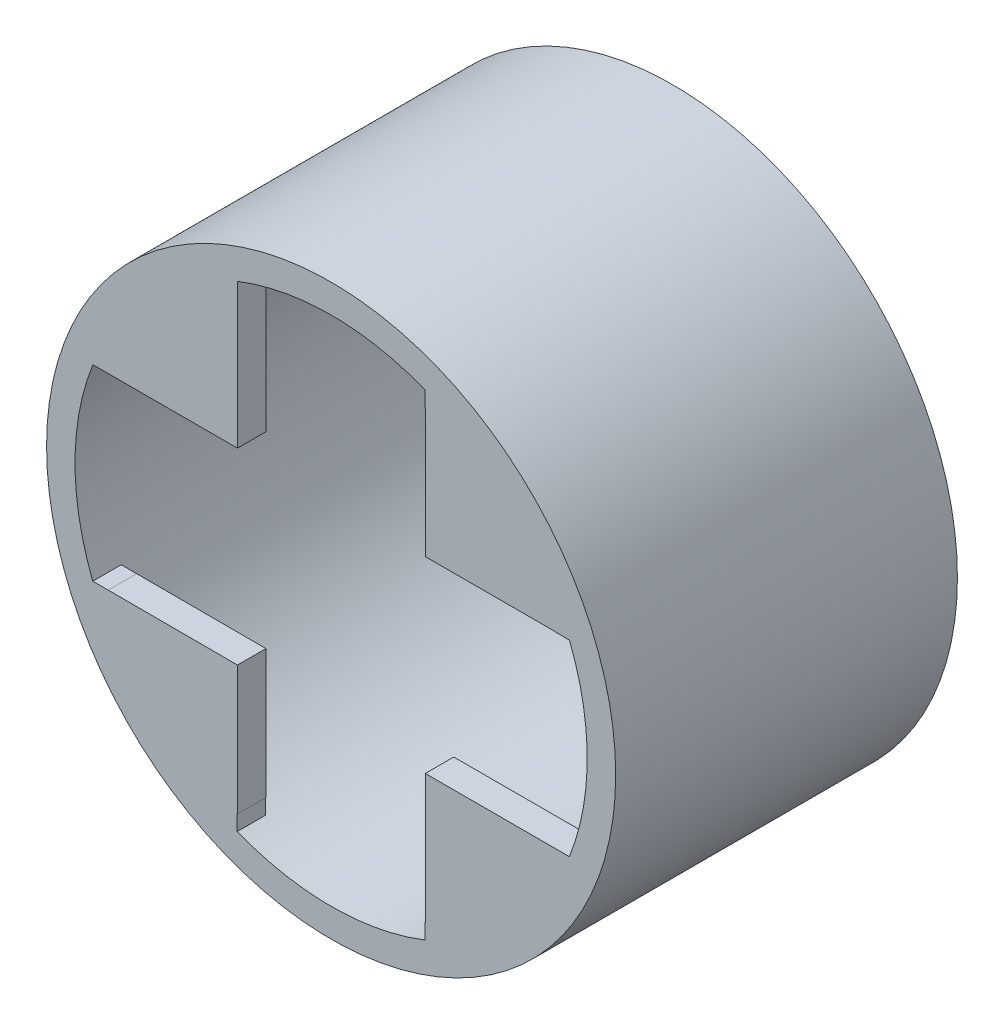
ISO-10303-21;
HEADER;
FILE_DESCRIPTION(('STEP AP214'),'2;1');
FILE_NAME('part.step','',(''),(''),'','','');
FILE_SCHEMA(('AUTOMOTIVE_DESIGN { 1 0 10303 214 1 1 1 1 }'));
ENDSEC;
DATA;
#1=APPLICATION_CONTEXT('core data for automotive mechanical design processes');
#2=APPLICATION_PROTOCOL_DEFINITION('international standard','automotive_design',2000,#1);
#3=PRODUCT_CONTEXT('',#1,'mechanical');
#4=PRODUCT('Part','Part','',(#3));
#5=PRODUCT_RELATED_PRODUCT_CATEGORY('part','',(#4));
#6=PRODUCT_DEFINITION_FORMATION('','',#4);
#7=PRODUCT_DEFINITION_CONTEXT('part definition',#1,'design');
#8=PRODUCT_DEFINITION('design','',#6,#7);
#9=PRODUCT_DEFINITION_SHAPE('','',#8);
#10=(LENGTH_UNIT() NAMED_UNIT(*) SI_UNIT(.MILLI.,.METRE.));
#11=(NAMED_UNIT(*) PLANE_ANGLE_UNIT() SI_UNIT($,.RADIAN.));
#12=(NAMED_UNIT(*) SI_UNIT($,.STERADIAN.) SOLID_ANGLE_UNIT());
#13=UNCERTAINTY_MEASURE_WITH_UNIT(LENGTH_MEASURE(1.E-05),#10,'distance_accuracy_value','');
#14=(GEOMETRIC_REPRESENTATION_CONTEXT(3) GLOBAL_UNCERTAINTY_ASSIGNED_CONTEXT((#13)) GLOBAL_UNIT_ASSIGNED_CONTEXT((#10,
#11,#12)) REPRESENTATION_CONTEXT('',''));
#15=CARTESIAN_POINT('',(0.,0.,0.));
#16=DIRECTION('',(0.,0.,1.));
#17=DIRECTION('',(1.,0.,0.));
#18=AXIS2_PLACEMENT_3D('',#15,#16,#17);
#19=CARTESIAN_POINT('',(-55.,-65.,10.));
#20=DIRECTION('',(0.,0.,1.));
#21=DIRECTION('',(1.,0.,0.));
#22=AXIS2_PLACEMENT_3D('',#19,#20,#21);
#23=PLANE('',#22);
#24=CARTESIAN_POINT('',(0.,0.,10.));
#25=DIRECTION('',(0.,0.,1.));
#26=DIRECTION('',(1.,0.,0.));
#27=AXIS2_PLACEMENT_3D('',#24,#25,#26);
#28=CIRCLE('',#27,45.);
#29=CARTESIAN_POINT('',(45.,0.,10.));
#30=VERTEX_POINT('',#29);
#31=EDGE_CURVE('E41',#30,#30,#28,.T.);
#32=ORIENTED_EDGE('',*,*,#31,.T.);
#33=EDGE_LOOP('',(#32));
#34=FACE_BOUND('',#33,.T.);
#35=CARTESIAN_POINT('',(0.,0.,10.));
#36=DIRECTION('',(0.,0.,1.));
#37=DIRECTION('',(1.,0.,0.));
#38=AXIS2_PLACEMENT_3D('',#35,#36,#37);
#39=CIRCLE('',#38,50.);
#40=CARTESIAN_POINT('',(50.,0.,10.));
#41=VERTEX_POINT('',#40);
#42=EDGE_CURVE('E213',#41,#41,#39,.T.);
#43=ORIENTED_EDGE('',*,*,#42,.F.);
#44=EDGE_LOOP('',(#43));
#45=FACE_BOUND('',#44,.T.);
#46=ADVANCED_FACE('F37',(#34,#45),#23,.F.);
#47=CARTESIAN_POINT('',(-16.4555308979155,-16.5,70.05));
#48=DIRECTION('',(0.,0.,1.));
#49=DIRECTION('',(1.,0.,0.));
#50=AXIS2_PLACEMENT_3D('',#47,#48,#49);
#51=PLANE('',#50);
#52=CARTESIAN_POINT('',(0.,0.,70.05));
#53=DIRECTION('',(0.,0.,1.));
#54=DIRECTION('',(1.,0.,0.));
#55=AXIS2_PLACEMENT_3D('',#52,#53,#54);
#56=CIRCLE('',#55,50.);
#57=CARTESIAN_POINT('',(50.,0.,70.05));
#58=VERTEX_POINT('',#57);
#59=EDGE_CURVE('E407',#58,#58,#56,.T.);
#60=ORIENTED_EDGE('',*,*,#59,.T.);
#61=EDGE_LOOP('',(#60));
#62=FACE_BOUND('',#61,.T.);
#63=CARTESIAN_POINT('',(0.,0.,70.05));
#64=DIRECTION('',(0.,0.,1.));
#65=DIRECTION('',(1.,0.,0.));
#66=AXIS2_PLACEMENT_3D('',#63,#64,#65);
#67=CIRCLE('',#66,45.);
#68=CARTESIAN_POINT('',(-41.8658572108586,16.5,70.05));
#69=VERTEX_POINT('',#68);
#70=CARTESIAN_POINT('',(-41.8833559169712,-16.4555308979174,70.05));
#71=VERTEX_POINT('',#70);
#72=EDGE_CURVE('E208',#69,#71,#67,.T.);
#73=ORIENTED_EDGE('',*,*,#72,.F.);
#74=DIRECTION('',(-1.,0.,0.));
#75=VECTOR('',#74,1.);
#76=CARTESIAN_POINT('',(0.,16.5,70.05));
#77=LINE('',#76,#75);
#78=CARTESIAN_POINT('',(-16.4555308979174,16.5,70.05));
#79=VERTEX_POINT('',#78);
#80=EDGE_CURVE('E261',#79,#69,#77,.T.);
#81=ORIENTED_EDGE('',*,*,#80,.F.);
#82=DIRECTION('',(0.,-1.,0.));
#83=VECTOR('',#82,1.);
#84=CARTESIAN_POINT('',(-16.4555308979174,0.,70.05));
#85=LINE('',#84,#83);
#86=CARTESIAN_POINT('',(-16.4555308979174,41.8833559169712,70.05));
#87=VERTEX_POINT('',#86);
#88=EDGE_CURVE('E246',#87,#79,#85,.T.);
#89=ORIENTED_EDGE('',*,*,#88,.F.);
#90=CARTESIAN_POINT('',(16.5,41.8658572108586,70.05));
#91=VERTEX_POINT('',#90);
#92=EDGE_CURVE('E214',#91,#87,#67,.T.);
#93=ORIENTED_EDGE('',*,*,#92,.F.);
#94=DIRECTION('',(0.,1.,0.));
#95=VECTOR('',#94,1.);
#96=CARTESIAN_POINT('',(16.5,0.,70.05));
#97=LINE('',#96,#95);
#98=CARTESIAN_POINT('',(16.5,39.1850163055687,70.05));
#99=VERTEX_POINT('',#98);
#100=EDGE_CURVE('E224',#99,#91,#97,.T.);
#101=ORIENTED_EDGE('',*,*,#100,.F.);
#102=CARTESIAN_POINT('',(0.0444691020826324,0.,70.05));
#103=DIRECTION('',(0.,0.,1.));
#104=DIRECTION('',(1.,0.,0.));
#105=AXIS2_PLACEMENT_3D('',#102,#103,#104);
#106=CIRCLE('',#105,42.5);
#107=CARTESIAN_POINT('',(16.5444691020823,39.1663120551334,70.05));
#108=VERTEX_POINT('',#107);
#109=EDGE_CURVE('E234',#108,#99,#106,.T.);
#110=ORIENTED_EDGE('',*,*,#109,.F.);
#111=DIRECTION('',(0.,1.,0.));
#112=VECTOR('',#111,1.);
#113=CARTESIAN_POINT('',(16.5444691020827,0.,70.05));
#114=LINE('',#113,#112);
#115=CARTESIAN_POINT('',(16.5444691020826,16.5000000000019,70.05));
#116=VERTEX_POINT('',#115);
#117=EDGE_CURVE('E243',#116,#108,#114,.T.);
#118=ORIENTED_EDGE('',*,*,#117,.F.);
#119=DIRECTION('',(-1.,0.,0.));
#120=VECTOR('',#119,1.);
#121=CARTESIAN_POINT('',(0.,16.5000000000019,70.05));
#122=LINE('',#121,#120);
#123=CARTESIAN_POINT('',(39.2107811572146,16.5000000000017,70.05));
#124=VERTEX_POINT('',#123);
#125=EDGE_CURVE('E232',#124,#116,#122,.T.);
#126=ORIENTED_EDGE('',*,*,#125,.F.);
#127=CARTESIAN_POINT('',(39.2294854076501,16.4555308979205,70.05));
#128=VERTEX_POINT('',#127);
#129=EDGE_CURVE('E223',#128,#124,#106,.T.);
#130=ORIENTED_EDGE('',*,*,#129,.F.);
#131=DIRECTION('',(1.,0.,0.));
#132=VECTOR('',#131,1.);
#133=CARTESIAN_POINT('',(0.,16.4555308979205,70.05));
#134=LINE('',#133,#132);
#135=CARTESIAN_POINT('',(41.88335591697,16.4555308979205,70.05));
#136=VERTEX_POINT('',#135);
#137=EDGE_CURVE('E220',#128,#136,#134,.T.);
#138=ORIENTED_EDGE('',*,*,#137,.T.);
#139=CARTESIAN_POINT('',(41.8658572108593,-16.4999999999981,70.05));
#140=VERTEX_POINT('',#139);
#141=EDGE_CURVE('E207',#140,#136,#67,.T.);
#142=ORIENTED_EDGE('',*,*,#141,.F.);
#143=DIRECTION('',(1.,0.,0.));
#144=VECTOR('',#143,1.);
#145=CARTESIAN_POINT('',(0.,-16.4999999999981,70.05));
#146=LINE('',#145,#144);
#147=CARTESIAN_POINT('',(16.5444691020845,-16.4999999999981,70.05));
#148=VERTEX_POINT('',#147);
#149=EDGE_CURVE('E218',#148,#140,#146,.T.);
#150=ORIENTED_EDGE('',*,*,#149,.F.);
#151=DIRECTION('',(0.,1.,0.));
#152=VECTOR('',#151,1.);
#153=CARTESIAN_POINT('',(16.5444691020845,0.,70.05));
#154=LINE('',#153,#152);
#155=CARTESIAN_POINT('',(16.5444691020847,-39.1663120551309,70.05));
#156=VERTEX_POINT('',#155);
#157=EDGE_CURVE('E415',#156,#148,#154,.T.);
#158=ORIENTED_EDGE('',*,*,#157,.F.);
#159=CARTESIAN_POINT('',(0.0444691020826324,0.,70.05));
#160=DIRECTION('',(0.,0.,1.));
#161=DIRECTION('',(1.,0.,0.));
#162=AXIS2_PLACEMENT_3D('',#159,#160,#161);
#163=CIRCLE('',#162,42.5);
#164=CARTESIAN_POINT('',(16.4555308979205,-39.2036611904193,70.05));
#165=VERTEX_POINT('',#164);
#166=EDGE_CURVE('E273',#165,#156,#163,.T.);
#167=ORIENTED_EDGE('',*,*,#166,.F.);
#168=DIRECTION('',(0.,-1.,0.));
#169=VECTOR('',#168,1.);
#170=CARTESIAN_POINT('',(16.4555308979205,0.,70.05));
#171=LINE('',#170,#169);
#172=CARTESIAN_POINT('',(16.4555308979205,-41.88335591697,70.05));
#173=VERTEX_POINT('',#172);
#174=EDGE_CURVE('E205',#165,#173,#171,.T.);
#175=ORIENTED_EDGE('',*,*,#174,.T.);
#176=CARTESIAN_POINT('',(-16.4999999999969,-41.8658572108598,70.05));
#177=VERTEX_POINT('',#176);
#178=EDGE_CURVE('E193',#177,#173,#67,.T.);
#179=ORIENTED_EDGE('',*,*,#178,.F.);
#180=DIRECTION('',(0.,-1.,0.));
#181=VECTOR('',#180,1.);
#182=CARTESIAN_POINT('',(-16.4999999999969,0.,70.05));
#183=LINE('',#182,#181);
#184=CARTESIAN_POINT('',(-16.4999999999969,-39.14754835402,70.05));
#185=VERTEX_POINT('',#184);
#186=EDGE_CURVE('E183',#185,#177,#183,.T.);
#187=ORIENTED_EDGE('',*,*,#186,.F.);
#188=CARTESIAN_POINT('',(0.0444691020826324,0.,70.05));
#189=DIRECTION('',(0.,0.,1.));
#190=DIRECTION('',(1.,0.,0.));
#191=AXIS2_PLACEMENT_3D('',#188,#189,#190);
#192=CIRCLE('',#191,42.5);
#193=CARTESIAN_POINT('',(-16.4555308979155,-39.1663120551323,70.05));
#194=VERTEX_POINT('',#193);
#195=EDGE_CURVE('E191',#185,#194,#192,.T.);
#196=ORIENTED_EDGE('',*,*,#195,.T.);
#197=DIRECTION('',(0.,-1.,0.));
#198=VECTOR('',#197,1.);
#199=CARTESIAN_POINT('',(-16.4555308979155,0.,70.05));
#200=LINE('',#199,#198);
#201=CARTESIAN_POINT('',(-16.4555308979155,-16.5,70.05));
#202=VERTEX_POINT('',#201);
#203=EDGE_CURVE('E320',#202,#194,#200,.T.);
#204=ORIENTED_EDGE('',*,*,#203,.F.);
#205=DIRECTION('',(0.99999808300345,-0.00195805756427557,0.));
#206=VECTOR('',#205,1.);
#207=CARTESIAN_POINT('',(-0.0323709782077643,-16.532157554156,70.05));
#208=LINE('',#207,#206);
#209=CARTESIAN_POINT('',(-39.1663120551292,-16.4555308979174,70.05));
#210=VERTEX_POINT('',#209);
#211=EDGE_CURVE('E268',#210,#202,#208,.T.);
#212=ORIENTED_EDGE('',*,*,#211,.F.);
#213=DIRECTION('',(-1.,0.,0.));
#214=VECTOR('',#213,1.);
#215=CARTESIAN_POINT('',(0.,-16.4555308979174,70.05));
#216=LINE('',#215,#214);
#217=EDGE_CURVE('E190',#210,#71,#216,.T.);
#218=ORIENTED_EDGE('',*,*,#217,.T.);
#219=EDGE_LOOP('',(#73,#81,#89,#93,#101,#110,#118,#126,#130,#138,#142,#150,#158,#167,#175,#179,
#187,#196,#204,#212,#218));
#220=FACE_BOUND('',#219,.T.);
#221=ADVANCED_FACE('F202',(#62,#220),#51,.T.);
#222=CARTESIAN_POINT('',(-0.0323709782077643,-16.532157554156,70.05));
#223=DIRECTION('',(0.00195805756427557,0.99999808300345,0.));
#224=DIRECTION('',(-0.99999808300345,0.00195805756427557,0.));
#225=AXIS2_PLACEMENT_3D('',#222,#223,#224);
#226=PLANE('',#225);
#227=DIRECTION('',(0.99999808300345,-0.00195805756427557,0.));
#228=VECTOR('',#227,1.);
#229=CARTESIAN_POINT('',(-0.0323709782077643,-16.532157554156,65.05));
#230=LINE('',#229,#228);
#231=CARTESIAN_POINT('',(-39.1663120551292,-16.4555308979174,65.05));
#232=VERTEX_POINT('',#231);
#233=CARTESIAN_POINT('',(-16.4555308979155,-16.5,65.05));
#234=VERTEX_POINT('',#233);
#235=EDGE_CURVE('E327',#232,#234,#230,.T.);
#236=ORIENTED_EDGE('',*,*,#235,.F.);
#237=DIRECTION('',(0.,0.,-1.));
#238=VECTOR('',#237,1.);
#239=CARTESIAN_POINT('',(-39.1663120551292,-16.4555308979174,70.05));
#240=LINE('',#239,#238);
#241=EDGE_CURVE('E307',#210,#232,#240,.T.);
#242=ORIENTED_EDGE('',*,*,#241,.F.);
#243=ORIENTED_EDGE('',*,*,#211,.T.);
#244=DIRECTION('',(0.,0.,-1.));
#245=VECTOR('',#244,1.);
#246=CARTESIAN_POINT('',(-16.4555308979155,-16.5,70.05));
#247=LINE('',#246,#245);
#248=EDGE_CURVE('E304',#202,#234,#247,.T.);
#249=ORIENTED_EDGE('',*,*,#248,.T.);
#250=EDGE_LOOP('',(#236,#242,#243,#249));
#251=FACE_BOUND('',#250,.T.);
#252=ADVANCED_FACE('F515',(#251),#226,.T.);
#253=CARTESIAN_POINT('',(0.,16.5,70.05));
#254=DIRECTION('',(0.,-1.,0.));
#255=DIRECTION('',(1.,0.,0.));
#256=AXIS2_PLACEMENT_3D('',#253,#254,#255);
#257=PLANE('',#256);
#258=ORIENTED_EDGE('',*,*,#80,.T.);
#259=DIRECTION('',(0.,0.,-1.));
#260=VECTOR('',#259,1.);
#261=CARTESIAN_POINT('',(-41.8658572108586,16.5,75.05));
#262=LINE('',#261,#260);
#263=CARTESIAN_POINT('',(-41.8658572108586,16.5,65.05));
#264=VERTEX_POINT('',#263);
#265=EDGE_CURVE('E257',#69,#264,#262,.T.);
#266=ORIENTED_EDGE('',*,*,#265,.T.);
#267=DIRECTION('',(-1.,0.,0.));
#268=VECTOR('',#267,1.);
#269=CARTESIAN_POINT('',(0.,16.5,65.05));
#270=LINE('',#269,#268);
#271=CARTESIAN_POINT('',(-16.4555308979174,16.5,65.05));
#272=VERTEX_POINT('',#271);
#273=EDGE_CURVE('E346',#272,#264,#270,.T.);
#274=ORIENTED_EDGE('',*,*,#273,.F.);
#275=DIRECTION('',(0.,0.,-1.));
#276=VECTOR('',#275,1.);
#277=CARTESIAN_POINT('',(-16.4555308979174,16.5,70.05));
#278=LINE('',#277,#276);
#279=EDGE_CURVE('E265',#79,#272,#278,.T.);
#280=ORIENTED_EDGE('',*,*,#279,.F.);
#281=EDGE_LOOP('',(#258,#266,#274,#280));
#282=FACE_BOUND('',#281,.T.);
#283=ADVANCED_FACE('F504',(#282),#257,.T.);
#284=CARTESIAN_POINT('',(0.0444691020826324,0.,70.05));
#285=DIRECTION('',(0.,0.,-1.));
#286=DIRECTION('',(-1.,0.,0.));
#287=AXIS2_PLACEMENT_3D('',#284,#285,#286);
#288=CYLINDRICAL_SURFACE('',#287,42.5);
#289=CARTESIAN_POINT('',(0.0444691020826324,0.,65.05));
#290=DIRECTION('',(0.,0.,1.));
#291=DIRECTION('',(1.,0.,0.));
#292=AXIS2_PLACEMENT_3D('',#289,#290,#291);
#293=CIRCLE('',#292,42.5);
#294=CARTESIAN_POINT('',(39.2294854076501,16.4555308979205,65.05));
#295=VERTEX_POINT('',#294);
#296=CARTESIAN_POINT('',(39.2107811572146,16.5000000000017,65.05));
#297=VERTEX_POINT('',#296);
#298=EDGE_CURVE('E381',#295,#297,#293,.T.);
#299=ORIENTED_EDGE('',*,*,#298,.F.);
#300=DIRECTION('',(0.,0.,-1.));
#301=VECTOR('',#300,1.);
#302=CARTESIAN_POINT('',(39.2294854076501,16.4555308979205,70.05));
#303=LINE('',#302,#301);
#304=EDGE_CURVE('E356',#128,#295,#303,.T.);
#305=ORIENTED_EDGE('',*,*,#304,.F.);
#306=ORIENTED_EDGE('',*,*,#129,.T.);
#307=DIRECTION('',(0.,0.,-1.));
#308=VECTOR('',#307,1.);
#309=CARTESIAN_POINT('',(39.2107811572146,16.5000000000017,70.05));
#310=LINE('',#309,#308);
#311=EDGE_CURVE('E353',#124,#297,#310,.T.);
#312=ORIENTED_EDGE('',*,*,#311,.T.);
#313=EDGE_LOOP('',(#299,#305,#306,#312));
#314=FACE_BOUND('',#313,.T.);
#315=ADVANCED_FACE('F456',(#314),#288,.F.);
#316=CARTESIAN_POINT('',(0.,-16.4999999999981,70.05));
#317=DIRECTION('',(0.,1.,0.));
#318=DIRECTION('',(-1.,0.,0.));
#319=AXIS2_PLACEMENT_3D('',#316,#317,#318);
#320=PLANE('',#319);
#321=ORIENTED_EDGE('',*,*,#149,.T.);
#322=DIRECTION('',(0.,0.,-1.));
#323=VECTOR('',#322,1.);
#324=CARTESIAN_POINT('',(41.8658572108593,-16.4999999999981,75.05));
#325=LINE('',#324,#323);
#326=CARTESIAN_POINT('',(41.8658572108593,-16.4999999999981,65.05));
#327=VERTEX_POINT('',#326);
#328=EDGE_CURVE('E47',#140,#327,#325,.T.);
#329=ORIENTED_EDGE('',*,*,#328,.T.);
#330=DIRECTION('',(1.,0.,0.));
#331=VECTOR('',#330,1.);
#332=CARTESIAN_POINT('',(0.,-16.4999999999981,65.05));
#333=LINE('',#332,#331);
#334=CARTESIAN_POINT('',(16.5444691020845,-16.4999999999981,65.05));
#335=VERTEX_POINT('',#334);
#336=EDGE_CURVE('E260',#335,#327,#333,.T.);
#337=ORIENTED_EDGE('',*,*,#336,.F.);
#338=DIRECTION('',(0.,0.,-1.));
#339=VECTOR('',#338,1.);
#340=CARTESIAN_POINT('',(16.5444691020845,-16.4999999999981,70.05));
#341=LINE('',#340,#339);
#342=EDGE_CURVE('E389',#148,#335,#341,.T.);
#343=ORIENTED_EDGE('',*,*,#342,.F.);
#344=EDGE_LOOP('',(#321,#329,#337,#343));
#345=FACE_BOUND('',#344,.T.);
#346=ADVANCED_FACE('F281',(#345),#320,.T.);
#347=CARTESIAN_POINT('',(16.5444691020845,0.,70.05));
#348=DIRECTION('',(-1.,0.,0.));
#349=DIRECTION('',(0.,-1.,0.));
#350=AXIS2_PLACEMENT_3D('',#347,#348,#349);
#351=PLANE('',#350);
#352=DIRECTION('',(0.,1.,0.));
#353=VECTOR('',#352,1.);
#354=CARTESIAN_POINT('',(16.5444691020845,0.,65.05));
#355=LINE('',#354,#353);
#356=CARTESIAN_POINT('',(16.5444691020847,-39.1663120551309,65.05));
#357=VERTEX_POINT('',#356);
#358=EDGE_CURVE('E291',#357,#335,#355,.T.);
#359=ORIENTED_EDGE('',*,*,#358,.F.);
#360=DIRECTION('',(0.,0.,-1.));
#361=VECTOR('',#360,1.);
#362=CARTESIAN_POINT('',(16.5444691020847,-39.1663120551309,70.05));
#363=LINE('',#362,#361);
#364=EDGE_CURVE('E398',#156,#357,#363,.T.);
#365=ORIENTED_EDGE('',*,*,#364,.F.);
#366=ORIENTED_EDGE('',*,*,#157,.T.);
#367=ORIENTED_EDGE('',*,*,#342,.T.);
#368=EDGE_LOOP('',(#359,#365,#366,#367));
#369=FACE_BOUND('',#368,.T.);
#370=ADVANCED_FACE('F575',(#369),#351,.T.);
#371=CARTESIAN_POINT('',(0.,0.,65.05));
#372=DIRECTION('',(0.,0.,1.));
#373=DIRECTION('',(1.,0.,0.));
#374=AXIS2_PLACEMENT_3D('',#371,#372,#373);
#375=PLANE('',#374);
#376=CARTESIAN_POINT('',(0.,0.,65.05));
#377=DIRECTION('',(0.,0.,1.));
#378=DIRECTION('',(1.,0.,0.));
#379=AXIS2_PLACEMENT_3D('',#376,#377,#378);
#380=CIRCLE('',#379,45.);
#381=CARTESIAN_POINT('',(16.4555308979205,-41.88335591697,65.05));
#382=VERTEX_POINT('',#381);
#383=EDGE_CURVE('E287',#382,#327,#380,.T.);
#384=ORIENTED_EDGE('',*,*,#383,.F.);
#385=DIRECTION('',(0.,-1.,0.));
#386=VECTOR('',#385,1.);
#387=CARTESIAN_POINT('',(16.4555308979205,0.,65.05));
#388=LINE('',#387,#386);
#389=CARTESIAN_POINT('',(16.4555308979205,-39.2036611904193,65.05));
#390=VERTEX_POINT('',#389);
#391=EDGE_CURVE('E403',#390,#382,#388,.T.);
#392=ORIENTED_EDGE('',*,*,#391,.F.);
#393=CARTESIAN_POINT('',(0.0444691020826324,0.,65.05));
#394=DIRECTION('',(0.,0.,1.));
#395=DIRECTION('',(1.,0.,0.));
#396=AXIS2_PLACEMENT_3D('',#393,#394,#395);
#397=CIRCLE('',#396,42.5);
#398=EDGE_CURVE('E406',#390,#357,#397,.T.);
#399=ORIENTED_EDGE('',*,*,#398,.T.);
#400=ORIENTED_EDGE('',*,*,#358,.T.);
#401=ORIENTED_EDGE('',*,*,#336,.T.);
#402=EDGE_LOOP('',(#384,#392,#399,#400,#401));
#403=FACE_BOUND('',#402,.T.);
#404=ADVANCED_FACE('F285',(#403),#375,.F.);
#405=CARTESIAN_POINT('',(0.0444691020826324,0.,70.05));
#406=DIRECTION('',(0.,0.,-1.));
#407=DIRECTION('',(-1.,0.,0.));
#408=AXIS2_PLACEMENT_3D('',#405,#406,#407);
#409=CYLINDRICAL_SURFACE('',#408,42.5);
#410=ORIENTED_EDGE('',*,*,#398,.F.);
#411=DIRECTION('',(0.,0.,-1.));
#412=VECTOR('',#411,1.);
#413=CARTESIAN_POINT('',(16.4555308979205,-39.2036611904193,70.05));
#414=LINE('',#413,#412);
#415=EDGE_CURVE('E274',#165,#390,#414,.T.);
#416=ORIENTED_EDGE('',*,*,#415,.F.);
#417=ORIENTED_EDGE('',*,*,#166,.T.);
#418=ORIENTED_EDGE('',*,*,#364,.T.);
#419=EDGE_LOOP('',(#410,#416,#417,#418));
#420=FACE_BOUND('',#419,.T.);
#421=ADVANCED_FACE('F579',(#420),#409,.F.);
#422=CARTESIAN_POINT('',(0.,0.,65.05));
#423=DIRECTION('',(0.,0.,-1.));
#424=DIRECTION('',(-1.,0.,0.));
#425=AXIS2_PLACEMENT_3D('',#422,#423,#424);
#426=CYLINDRICAL_SURFACE('',#425,45.);
#427=ORIENTED_EDGE('',*,*,#31,.F.);
#428=EDGE_LOOP('',(#427));
#429=FACE_BOUND('',#428,.T.);
#430=DIRECTION('',(0.,0.,-1.));
#431=VECTOR('',#430,1.);
#432=CARTESIAN_POINT('',(16.5,41.8658572108586,75.05));
#433=LINE('',#432,#431);
#434=CARTESIAN_POINT('',(16.5,41.8658572108586,65.05));
#435=VERTEX_POINT('',#434);
#436=EDGE_CURVE('E251',#91,#435,#433,.T.);
#437=ORIENTED_EDGE('',*,*,#436,.F.);
#438=ORIENTED_EDGE('',*,*,#92,.T.);
#439=DIRECTION('',(0.,0.,-1.));
#440=VECTOR('',#439,1.);
#441=CARTESIAN_POINT('',(-16.4555308979174,41.8833559169712,75.05));
#442=LINE('',#441,#440);
#443=CARTESIAN_POINT('',(-16.4555308979174,41.8833559169712,65.05));
#444=VERTEX_POINT('',#443);
#445=EDGE_CURVE('E198',#87,#444,#442,.T.);
#446=ORIENTED_EDGE('',*,*,#445,.T.);
#447=EDGE_CURVE('E301',#444,#264,#380,.T.);
#448=ORIENTED_EDGE('',*,*,#447,.T.);
#449=ORIENTED_EDGE('',*,*,#265,.F.);
#450=ORIENTED_EDGE('',*,*,#72,.T.);
#451=DIRECTION('',(0.,0.,-1.));
#452=VECTOR('',#451,1.);
#453=CARTESIAN_POINT('',(-41.8833559169712,-16.4555308979174,75.05));
#454=LINE('',#453,#452);
#455=CARTESIAN_POINT('',(-41.8833559169712,-16.4555308979174,65.05));
#456=VERTEX_POINT('',#455);
#457=EDGE_CURVE('E254',#71,#456,#454,.T.);
#458=ORIENTED_EDGE('',*,*,#457,.T.);
#459=CARTESIAN_POINT('',(-16.4999999999969,-41.8658572108598,65.05));
#460=VERTEX_POINT('',#459);
#461=EDGE_CURVE('E195',#456,#460,#380,.T.);
#462=ORIENTED_EDGE('',*,*,#461,.T.);
#463=DIRECTION('',(0.,0.,-1.));
#464=VECTOR('',#463,1.);
#465=CARTESIAN_POINT('',(-16.4999999999969,-41.8658572108598,75.05));
#466=LINE('',#465,#464);
#467=EDGE_CURVE('E63',#177,#460,#466,.T.);
#468=ORIENTED_EDGE('',*,*,#467,.F.);
#469=ORIENTED_EDGE('',*,*,#178,.T.);
#470=DIRECTION('',(0.,0.,-1.));
#471=VECTOR('',#470,1.);
#472=CARTESIAN_POINT('',(16.4555308979205,-41.88335591697,75.05));
#473=LINE('',#472,#471);
#474=EDGE_CURVE('E55',#173,#382,#473,.T.);
#475=ORIENTED_EDGE('',*,*,#474,.T.);
#476=ORIENTED_EDGE('',*,*,#383,.T.);
#477=ORIENTED_EDGE('',*,*,#328,.F.);
#478=ORIENTED_EDGE('',*,*,#141,.T.);
#479=DIRECTION('',(0.,0.,-1.));
#480=VECTOR('',#479,1.);
#481=CARTESIAN_POINT('',(41.88335591697,16.4555308979205,75.05));
#482=LINE('',#481,#480);
#483=CARTESIAN_POINT('',(41.88335591697,16.4555308979205,65.05));
#484=VERTEX_POINT('',#483);
#485=EDGE_CURVE('E11',#136,#484,#482,.T.);
#486=ORIENTED_EDGE('',*,*,#485,.T.);
#487=EDGE_CURVE('E295',#484,#435,#380,.T.);
#488=ORIENTED_EDGE('',*,*,#487,.T.);
#489=EDGE_LOOP('',(#437,#438,#446,#448,#449,#450,#458,#462,#468,#469,#475,#476,#477,#478,#486,#488));
#490=FACE_BOUND('',#489,.T.);
#491=ADVANCED_FACE('F39',(#429,#490),#426,.F.);
#492=CARTESIAN_POINT('',(16.4555308979205,0.,70.05));
#493=DIRECTION('',(1.,0.,0.));
#494=DIRECTION('',(0.,1.,0.));
#495=AXIS2_PLACEMENT_3D('',#492,#493,#494);
#496=PLANE('',#495);
#497=ORIENTED_EDGE('',*,*,#474,.F.);
#498=ORIENTED_EDGE('',*,*,#174,.F.);
#499=ORIENTED_EDGE('',*,*,#415,.T.);
#500=ORIENTED_EDGE('',*,*,#391,.T.);
#501=EDGE_LOOP('',(#497,#498,#499,#500));
#502=FACE_BOUND('',#501,.T.);
#503=ADVANCED_FACE('F566',(#502),#496,.F.);
#504=CARTESIAN_POINT('',(16.5,0.,70.05));
#505=DIRECTION('',(-1.,0.,0.));
#506=DIRECTION('',(0.,-1.,0.));
#507=AXIS2_PLACEMENT_3D('',#504,#505,#506);
#508=PLANE('',#507);
#509=ORIENTED_EDGE('',*,*,#100,.T.);
#510=ORIENTED_EDGE('',*,*,#436,.T.);
#511=DIRECTION('',(0.,1.,0.));
#512=VECTOR('',#511,1.);
#513=CARTESIAN_POINT('',(16.5,0.,65.05));
#514=LINE('',#513,#512);
#515=CARTESIAN_POINT('',(16.5,39.1850163055687,65.05));
#516=VERTEX_POINT('',#515);
#517=EDGE_CURVE('E373',#516,#435,#514,.T.);
#518=ORIENTED_EDGE('',*,*,#517,.F.);
#519=DIRECTION('',(0.,0.,-1.));
#520=VECTOR('',#519,1.);
#521=CARTESIAN_POINT('',(16.5,39.1850163055687,70.05));
#522=LINE('',#521,#520);
#523=EDGE_CURVE('E359',#99,#516,#522,.T.);
#524=ORIENTED_EDGE('',*,*,#523,.F.);
#525=EDGE_LOOP('',(#509,#510,#518,#524));
#526=FACE_BOUND('',#525,.T.);
#527=ADVANCED_FACE('F449',(#526),#508,.T.);
#528=CARTESIAN_POINT('',(16.5444691020823,39.1663120551334,65.05));
#529=VERTEX_POINT('',#528);
#530=EDGE_CURVE('E372',#529,#516,#293,.T.);
#531=ORIENTED_EDGE('',*,*,#530,.F.);
#532=DIRECTION('',(0.,0.,-1.));
#533=VECTOR('',#532,1.);
#534=CARTESIAN_POINT('',(16.5444691020823,39.1663120551334,70.05));
#535=LINE('',#534,#533);
#536=EDGE_CURVE('E362',#108,#529,#535,.T.);
#537=ORIENTED_EDGE('',*,*,#536,.F.);
#538=ORIENTED_EDGE('',*,*,#109,.T.);
#539=ORIENTED_EDGE('',*,*,#523,.T.);
#540=EDGE_LOOP('',(#531,#537,#538,#539));
#541=FACE_BOUND('',#540,.T.);
#542=ADVANCED_FACE('F447',(#541),#288,.F.);
#543=CARTESIAN_POINT('',(0.,16.5000000000019,70.05));
#544=DIRECTION('',(0.,-1.,0.));
#545=DIRECTION('',(1.,0.,0.));
#546=AXIS2_PLACEMENT_3D('',#543,#544,#545);
#547=PLANE('',#546);
#548=DIRECTION('',(-1.,0.,0.));
#549=VECTOR('',#548,1.);
#550=CARTESIAN_POINT('',(0.,16.5000000000019,65.05));
#551=LINE('',#550,#549);
#552=CARTESIAN_POINT('',(16.5444691020826,16.5000000000019,65.05));
#553=VERTEX_POINT('',#552);
#554=EDGE_CURVE('E385',#297,#553,#551,.T.);
#555=ORIENTED_EDGE('',*,*,#554,.F.);
#556=ORIENTED_EDGE('',*,*,#311,.F.);
#557=ORIENTED_EDGE('',*,*,#125,.T.);
#558=DIRECTION('',(0.,0.,-1.));
#559=VECTOR('',#558,1.);
#560=CARTESIAN_POINT('',(16.5444691020826,16.5000000000019,70.05));
#561=LINE('',#560,#559);
#562=EDGE_CURVE('E365',#116,#553,#561,.T.);
#563=ORIENTED_EDGE('',*,*,#562,.T.);
#564=EDGE_LOOP('',(#555,#556,#557,#563));
#565=FACE_BOUND('',#564,.T.);
#566=ADVANCED_FACE('F559',(#565),#547,.T.);
#567=CARTESIAN_POINT('',(0.,0.,65.05));
#568=DIRECTION('',(0.,0.,1.));
#569=DIRECTION('',(1.,0.,0.));
#570=AXIS2_PLACEMENT_3D('',#567,#568,#569);
#571=PLANE('',#570);
#572=ORIENTED_EDGE('',*,*,#487,.F.);
#573=DIRECTION('',(1.,0.,0.));
#574=VECTOR('',#573,1.);
#575=CARTESIAN_POINT('',(0.,16.4555308979205,65.05));
#576=LINE('',#575,#574);
#577=EDGE_CURVE('E377',#295,#484,#576,.T.);
#578=ORIENTED_EDGE('',*,*,#577,.F.);
#579=ORIENTED_EDGE('',*,*,#298,.T.);
#580=ORIENTED_EDGE('',*,*,#554,.T.);
#581=DIRECTION('',(0.,1.,0.));
#582=VECTOR('',#581,1.);
#583=CARTESIAN_POINT('',(16.5444691020827,0.,65.05));
#584=LINE('',#583,#582);
#585=EDGE_CURVE('E368',#553,#529,#584,.T.);
#586=ORIENTED_EDGE('',*,*,#585,.T.);
#587=ORIENTED_EDGE('',*,*,#530,.T.);
#588=ORIENTED_EDGE('',*,*,#517,.T.);
#589=EDGE_LOOP('',(#572,#578,#579,#580,#586,#587,#588));
#590=FACE_BOUND('',#589,.T.);
#591=ADVANCED_FACE('F443',(#590),#571,.F.);
#592=CARTESIAN_POINT('',(16.5444691020827,0.,70.05));
#593=DIRECTION('',(-1.,0.,0.));
#594=DIRECTION('',(0.,-1.,0.));
#595=AXIS2_PLACEMENT_3D('',#592,#593,#594);
#596=PLANE('',#595);
#597=ORIENTED_EDGE('',*,*,#585,.F.);
#598=ORIENTED_EDGE('',*,*,#562,.F.);
#599=ORIENTED_EDGE('',*,*,#117,.T.);
#600=ORIENTED_EDGE('',*,*,#536,.T.);
#601=EDGE_LOOP('',(#597,#598,#599,#600));
#602=FACE_BOUND('',#601,.T.);
#603=ADVANCED_FACE('F460',(#602),#596,.T.);
#604=CARTESIAN_POINT('',(0.,16.4555308979205,70.05));
#605=DIRECTION('',(0.,1.,0.));
#606=DIRECTION('',(0.,0.,1.));
#607=AXIS2_PLACEMENT_3D('',#604,#605,#606);
#608=PLANE('',#607);
#609=ORIENTED_EDGE('',*,*,#485,.F.);
#610=ORIENTED_EDGE('',*,*,#137,.F.);
#611=ORIENTED_EDGE('',*,*,#304,.T.);
#612=ORIENTED_EDGE('',*,*,#577,.T.);
#613=EDGE_LOOP('',(#609,#610,#611,#612));
#614=FACE_BOUND('',#613,.T.);
#615=ADVANCED_FACE('F454',(#614),#608,.F.);
#616=CARTESIAN_POINT('',(0.,0.,65.05));
#617=DIRECTION('',(0.,0.,1.));
#618=DIRECTION('',(1.,0.,0.));
#619=AXIS2_PLACEMENT_3D('',#616,#617,#618);
#620=PLANE('',#619);
#621=ORIENTED_EDGE('',*,*,#447,.F.);
#622=DIRECTION('',(0.,-1.,0.));
#623=VECTOR('',#622,1.);
#624=CARTESIAN_POINT('',(-16.4555308979174,0.,65.05));
#625=LINE('',#624,#623);
#626=EDGE_CURVE('E350',#444,#272,#625,.T.);
#627=ORIENTED_EDGE('',*,*,#626,.T.);
#628=ORIENTED_EDGE('',*,*,#273,.T.);
#629=EDGE_LOOP('',(#621,#627,#628));
#630=FACE_BOUND('',#629,.T.);
#631=ADVANCED_FACE('F501',(#630),#620,.F.);
#632=CARTESIAN_POINT('',(-16.4555308979174,0.,70.05));
#633=DIRECTION('',(1.,0.,0.));
#634=DIRECTION('',(0.,0.,-1.));
#635=AXIS2_PLACEMENT_3D('',#632,#633,#634);
#636=PLANE('',#635);
#637=ORIENTED_EDGE('',*,*,#626,.F.);
#638=ORIENTED_EDGE('',*,*,#445,.F.);
#639=ORIENTED_EDGE('',*,*,#88,.T.);
#640=ORIENTED_EDGE('',*,*,#279,.T.);
#641=EDGE_LOOP('',(#637,#638,#639,#640));
#642=FACE_BOUND('',#641,.T.);
#643=ADVANCED_FACE('F469',(#642),#636,.T.);
#644=CARTESIAN_POINT('',(-16.4999999999969,0.,70.05));
#645=DIRECTION('',(1.,0.,0.));
#646=DIRECTION('',(0.,1.,0.));
#647=AXIS2_PLACEMENT_3D('',#644,#645,#646);
#648=PLANE('',#647);
#649=ORIENTED_EDGE('',*,*,#186,.T.);
#650=ORIENTED_EDGE('',*,*,#467,.T.);
#651=DIRECTION('',(0.,-1.,0.));
#652=VECTOR('',#651,1.);
#653=CARTESIAN_POINT('',(-16.4999999999969,0.,65.05));
#654=LINE('',#653,#652);
#655=CARTESIAN_POINT('',(-16.4999999999969,-39.14754835402,65.05));
#656=VERTEX_POINT('',#655);
#657=EDGE_CURVE('E319',#656,#460,#654,.T.);
#658=ORIENTED_EDGE('',*,*,#657,.F.);
#659=DIRECTION('',(0.,0.,-1.));
#660=VECTOR('',#659,1.);
#661=CARTESIAN_POINT('',(-16.4999999999969,-39.14754835402,70.05));
#662=LINE('',#661,#660);
#663=EDGE_CURVE('E185',#185,#656,#662,.T.);
#664=ORIENTED_EDGE('',*,*,#663,.F.);
#665=EDGE_LOOP('',(#649,#650,#658,#664));
#666=FACE_BOUND('',#665,.T.);
#667=ADVANCED_FACE('F184',(#666),#648,.T.);
#668=CARTESIAN_POINT('',(-16.4555308979155,0.,70.05));
#669=DIRECTION('',(1.,0.,0.));
#670=DIRECTION('',(0.,1.,0.));
#671=AXIS2_PLACEMENT_3D('',#668,#669,#670);
#672=PLANE('',#671);
#673=DIRECTION('',(0.,-1.,0.));
#674=VECTOR('',#673,1.);
#675=CARTESIAN_POINT('',(-16.4555308979155,0.,65.05));
#676=LINE('',#675,#674);
#677=CARTESIAN_POINT('',(-16.4555308979155,-39.1663120551323,65.05));
#678=VERTEX_POINT('',#677);
#679=EDGE_CURVE('E331',#234,#678,#676,.T.);
#680=ORIENTED_EDGE('',*,*,#679,.F.);
#681=ORIENTED_EDGE('',*,*,#248,.F.);
#682=ORIENTED_EDGE('',*,*,#203,.T.);
#683=DIRECTION('',(0.,0.,-1.));
#684=VECTOR('',#683,1.);
#685=CARTESIAN_POINT('',(-16.4555308979155,-39.1663120551323,70.05));
#686=LINE('',#685,#684);
#687=EDGE_CURVE('E312',#194,#678,#686,.T.);
#688=ORIENTED_EDGE('',*,*,#687,.T.);
#689=EDGE_LOOP('',(#680,#681,#682,#688));
#690=FACE_BOUND('',#689,.T.);
#691=ADVANCED_FACE('F519',(#690),#672,.T.);
#692=CARTESIAN_POINT('',(0.,0.,65.05));
#693=DIRECTION('',(0.,0.,1.));
#694=DIRECTION('',(1.,0.,0.));
#695=AXIS2_PLACEMENT_3D('',#692,#693,#694);
#696=PLANE('',#695);
#697=ORIENTED_EDGE('',*,*,#461,.F.);
#698=DIRECTION('',(-1.,0.,0.));
#699=VECTOR('',#698,1.);
#700=CARTESIAN_POINT('',(0.,-16.4555308979174,65.05));
#701=LINE('',#700,#699);
#702=EDGE_CURVE('E323',#232,#456,#701,.T.);
#703=ORIENTED_EDGE('',*,*,#702,.F.);
#704=ORIENTED_EDGE('',*,*,#235,.T.);
#705=ORIENTED_EDGE('',*,*,#679,.T.);
#706=CARTESIAN_POINT('',(0.0444691020826324,0.,65.05));
#707=DIRECTION('',(0.,0.,1.));
#708=DIRECTION('',(1.,0.,0.));
#709=AXIS2_PLACEMENT_3D('',#706,#707,#708);
#710=CIRCLE('',#709,42.5);
#711=EDGE_CURVE('E315',#656,#678,#710,.T.);
#712=ORIENTED_EDGE('',*,*,#711,.F.);
#713=ORIENTED_EDGE('',*,*,#657,.T.);
#714=EDGE_LOOP('',(#697,#703,#704,#705,#712,#713));
#715=FACE_BOUND('',#714,.T.);
#716=ADVANCED_FACE('F513',(#715),#696,.F.);
#717=CARTESIAN_POINT('',(0.0444691020826324,0.,70.05));
#718=DIRECTION('',(0.,0.,-1.));
#719=DIRECTION('',(-1.,0.,0.));
#720=AXIS2_PLACEMENT_3D('',#717,#718,#719);
#721=CYLINDRICAL_SURFACE('',#720,42.5);
#722=ORIENTED_EDGE('',*,*,#711,.T.);
#723=ORIENTED_EDGE('',*,*,#687,.F.);
#724=ORIENTED_EDGE('',*,*,#195,.F.);
#725=ORIENTED_EDGE('',*,*,#663,.T.);
#726=EDGE_LOOP('',(#722,#723,#724,#725));
#727=FACE_BOUND('',#726,.T.);
#728=ADVANCED_FACE('F523',(#727),#721,.T.);
#729=CARTESIAN_POINT('',(0.,-16.4555308979174,70.05));
#730=DIRECTION('',(0.,-1.,0.));
#731=DIRECTION('',(0.,0.,-1.));
#732=AXIS2_PLACEMENT_3D('',#729,#730,#731);
#733=PLANE('',#732);
#734=ORIENTED_EDGE('',*,*,#457,.F.);
#735=ORIENTED_EDGE('',*,*,#217,.F.);
#736=ORIENTED_EDGE('',*,*,#241,.T.);
#737=ORIENTED_EDGE('',*,*,#702,.T.);
#738=EDGE_LOOP('',(#734,#735,#736,#737));
#739=FACE_BOUND('',#738,.T.);
#740=ADVANCED_FACE('F509',(#739),#733,.F.);
#741=CARTESIAN_POINT('',(0.,0.,65.05));
#742=DIRECTION('',(0.,0.,-1.));
#743=DIRECTION('',(-1.,0.,0.));
#744=AXIS2_PLACEMENT_3D('',#741,#742,#743);
#745=CYLINDRICAL_SURFACE('',#744,50.);
#746=ORIENTED_EDGE('',*,*,#42,.T.);
#747=EDGE_LOOP('',(#746));
#748=FACE_BOUND('',#747,.T.);
#749=ORIENTED_EDGE('',*,*,#59,.F.);
#750=EDGE_LOOP('',(#749));
#751=FACE_BOUND('',#750,.T.);
#752=ADVANCED_FACE('F530',(#748,#751),#745,.T.);
#753=CLOSED_SHELL('',(#46,#221,#252,#283,#315,#346,#370,#404,#421,#491,#503,#527,#542,#566,#591,
#603,#615,#631,#643,#667,#691,#716,#728,#740,#752));
#754=MANIFOLD_SOLID_BREP('B2',#753);
#755=ADVANCED_BREP_SHAPE_REPRESENTATION('',(#18,#754),#14);
#756=SHAPE_DEFINITION_REPRESENTATION(#9,#755);
ENDSEC;
END-ISO-10303-21;
